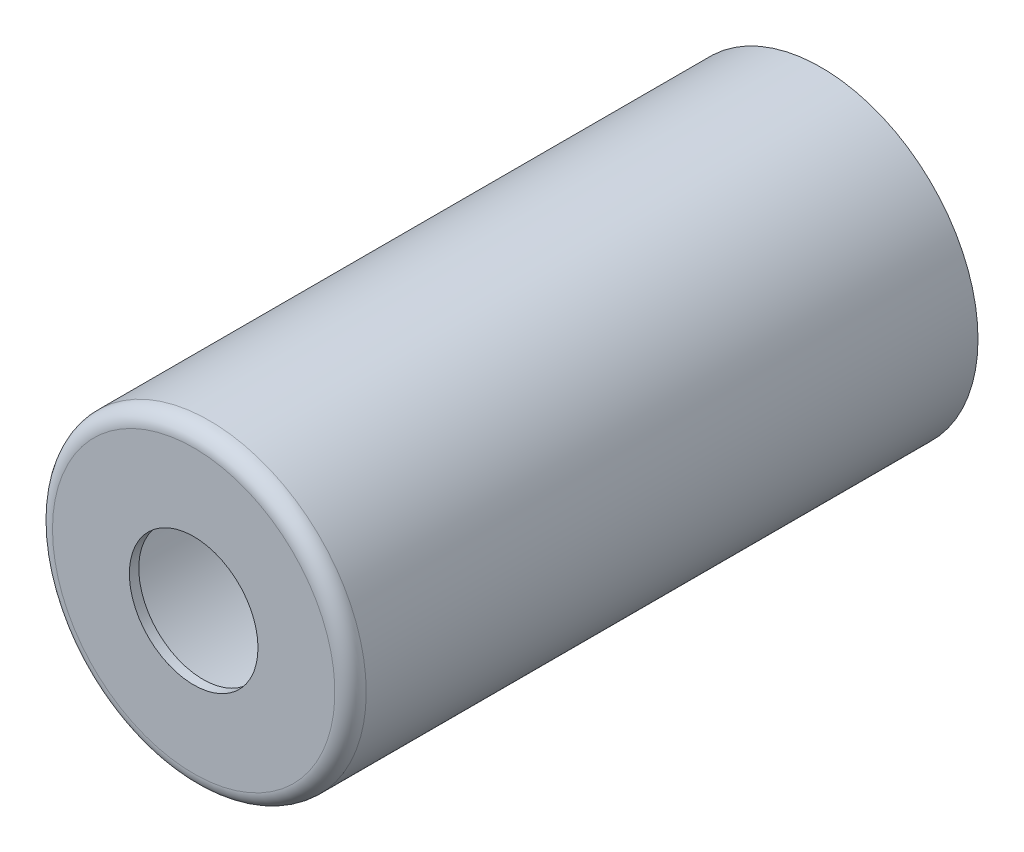
ISO-10303-21;
HEADER;
FILE_DESCRIPTION(('STEP AP214'),'2;1');
FILE_NAME('part.step','',(''),(''),'','','');
FILE_SCHEMA(('AUTOMOTIVE_DESIGN { 1 0 10303 214 1 1 1 1 }'));
ENDSEC;
DATA;
#1=APPLICATION_CONTEXT('core data for automotive mechanical design processes');
#2=APPLICATION_PROTOCOL_DEFINITION('international standard','automotive_design',2000,#1);
#3=PRODUCT_CONTEXT('',#1,'mechanical');
#4=PRODUCT('Part','Part','',(#3));
#5=PRODUCT_RELATED_PRODUCT_CATEGORY('part','',(#4));
#6=PRODUCT_DEFINITION_FORMATION('','',#4);
#7=PRODUCT_DEFINITION_CONTEXT('part definition',#1,'design');
#8=PRODUCT_DEFINITION('design','',#6,#7);
#9=PRODUCT_DEFINITION_SHAPE('','',#8);
#10=(LENGTH_UNIT() NAMED_UNIT(*) SI_UNIT(.MILLI.,.METRE.));
#11=(NAMED_UNIT(*) PLANE_ANGLE_UNIT() SI_UNIT($,.RADIAN.));
#12=(NAMED_UNIT(*) SI_UNIT($,.STERADIAN.) SOLID_ANGLE_UNIT());
#13=UNCERTAINTY_MEASURE_WITH_UNIT(LENGTH_MEASURE(1.E-05),#10,'distance_accuracy_value','');
#14=(GEOMETRIC_REPRESENTATION_CONTEXT(3) GLOBAL_UNCERTAINTY_ASSIGNED_CONTEXT((#13)) GLOBAL_UNIT_ASSIGNED_CONTEXT((#10,
#11,#12)) REPRESENTATION_CONTEXT('',''));
#15=CARTESIAN_POINT('',(0.,0.,0.));
#16=DIRECTION('',(0.,0.,1.));
#17=DIRECTION('',(1.,0.,0.));
#18=AXIS2_PLACEMENT_3D('',#15,#16,#17);
#19=CARTESIAN_POINT('',(0.,0.,0.));
#20=DIRECTION('',(0.,0.,1.));
#21=DIRECTION('',(1.,0.,0.));
#22=AXIS2_PLACEMENT_3D('',#19,#20,#21);
#23=CYLINDRICAL_SURFACE('',#22,50.);
#24=CARTESIAN_POINT('',(0.,0.,-5.));
#25=DIRECTION('',(0.,0.,-1.));
#26=DIRECTION('',(-1.,0.,0.));
#27=AXIS2_PLACEMENT_3D('',#24,#25,#26);
#28=CIRCLE('',#27,50.);
#29=CARTESIAN_POINT('',(-50.,0.,-5.));
#30=VERTEX_POINT('',#29);
#31=EDGE_CURVE('E10',#30,#30,#28,.T.);
#32=ORIENTED_EDGE('',*,*,#31,.T.);
#33=EDGE_LOOP('',(#32));
#34=FACE_BOUND('',#33,.T.);
#35=CARTESIAN_POINT('',(0.,0.,-200.));
#36=DIRECTION('',(0.,0.,1.));
#37=DIRECTION('',(1.,0.,0.));
#38=AXIS2_PLACEMENT_3D('',#35,#36,#37);
#39=CIRCLE('',#38,50.);
#40=CARTESIAN_POINT('',(50.,0.,-200.));
#41=VERTEX_POINT('',#40);
#42=EDGE_CURVE('E62',#41,#41,#39,.T.);
#43=ORIENTED_EDGE('',*,*,#42,.T.);
#44=EDGE_LOOP('',(#43));
#45=FACE_BOUND('',#44,.T.);
#46=ADVANCED_FACE('F33',(#34,#45),#23,.T.);
#47=CARTESIAN_POINT('',(0.,50.,0.));
#48=DIRECTION('',(0.,0.,-1.));
#49=DIRECTION('',(-1.,0.,0.));
#50=AXIS2_PLACEMENT_3D('',#47,#48,#49);
#51=PLANE('',#50);
#52=CARTESIAN_POINT('',(0.,0.,0.));
#53=DIRECTION('',(0.,0.,-1.));
#54=DIRECTION('',(-1.,0.,0.));
#55=AXIS2_PLACEMENT_3D('',#52,#53,#54);
#56=CIRCLE('',#55,45.);
#57=CARTESIAN_POINT('',(-45.,0.,0.));
#58=VERTEX_POINT('',#57);
#59=EDGE_CURVE('E40',#58,#58,#56,.F.);
#60=ORIENTED_EDGE('',*,*,#59,.T.);
#61=EDGE_LOOP('',(#60));
#62=FACE_BOUND('',#61,.T.);
#63=CARTESIAN_POINT('',(0.,0.,0.));
#64=DIRECTION('',(0.,0.,1.));
#65=DIRECTION('',(1.,0.,0.));
#66=AXIS2_PLACEMENT_3D('',#63,#64,#65);
#67=CIRCLE('',#66,20.5);
#68=CARTESIAN_POINT('',(20.5,0.,0.));
#69=VERTEX_POINT('',#68);
#70=EDGE_CURVE('E53',#69,#69,#67,.T.);
#71=ORIENTED_EDGE('',*,*,#70,.F.);
#72=EDGE_LOOP('',(#71));
#73=FACE_BOUND('',#72,.T.);
#74=ADVANCED_FACE('F86',(#62,#73),#51,.F.);
#75=CARTESIAN_POINT('',(0.,0.,0.));
#76=DIRECTION('',(0.,0.,1.));
#77=DIRECTION('',(1.,0.,0.));
#78=AXIS2_PLACEMENT_3D('',#75,#76,#77);
#79=CYLINDRICAL_SURFACE('',#78,20.5);
#80=CARTESIAN_POINT('',(0.,0.,-3.));
#81=DIRECTION('',(0.,0.,1.));
#82=DIRECTION('',(1.,0.,0.));
#83=AXIS2_PLACEMENT_3D('',#80,#81,#82);
#84=CIRCLE('',#83,20.5);
#85=CARTESIAN_POINT('',(20.5,0.,-3.));
#86=VERTEX_POINT('',#85);
#87=EDGE_CURVE('E56',#86,#86,#84,.T.);
#88=ORIENTED_EDGE('',*,*,#87,.F.);
#89=EDGE_LOOP('',(#88));
#90=FACE_BOUND('',#89,.T.);
#91=ORIENTED_EDGE('',*,*,#70,.T.);
#92=EDGE_LOOP('',(#91));
#93=FACE_BOUND('',#92,.T.);
#94=ADVANCED_FACE('F82',(#90,#93),#79,.F.);
#95=CARTESIAN_POINT('',(0.,20.5,-3.));
#96=DIRECTION('',(0.,0.,1.));
#97=DIRECTION('',(1.,0.,0.));
#98=AXIS2_PLACEMENT_3D('',#95,#96,#97);
#99=PLANE('',#98);
#100=CARTESIAN_POINT('',(0.,0.,-3.));
#101=DIRECTION('',(0.,0.,1.));
#102=DIRECTION('',(1.,0.,0.));
#103=AXIS2_PLACEMENT_3D('',#100,#101,#102);
#104=CIRCLE('',#103,42.);
#105=CARTESIAN_POINT('',(42.,0.,-3.));
#106=VERTEX_POINT('',#105);
#107=EDGE_CURVE('E44',#106,#106,#104,.F.);
#108=ORIENTED_EDGE('',*,*,#107,.T.);
#109=EDGE_LOOP('',(#108));
#110=FACE_BOUND('',#109,.T.);
#111=ORIENTED_EDGE('',*,*,#87,.T.);
#112=EDGE_LOOP('',(#111));
#113=FACE_BOUND('',#112,.T.);
#114=ADVANCED_FACE('F76',(#110,#113),#99,.F.);
#115=CARTESIAN_POINT('',(0.,0.,0.));
#116=DIRECTION('',(0.,0.,1.));
#117=DIRECTION('',(1.,0.,0.));
#118=AXIS2_PLACEMENT_3D('',#115,#116,#117);
#119=CYLINDRICAL_SURFACE('',#118,47.);
#120=CARTESIAN_POINT('',(0.,0.,-8.));
#121=DIRECTION('',(0.,0.,1.));
#122=DIRECTION('',(1.,0.,0.));
#123=AXIS2_PLACEMENT_3D('',#120,#121,#122);
#124=CIRCLE('',#123,47.);
#125=CARTESIAN_POINT('',(47.,0.,-8.));
#126=VERTEX_POINT('',#125);
#127=EDGE_CURVE('E48',#126,#126,#124,.T.);
#128=ORIENTED_EDGE('',*,*,#127,.T.);
#129=EDGE_LOOP('',(#128));
#130=FACE_BOUND('',#129,.T.);
#131=CARTESIAN_POINT('',(0.,0.,-200.));
#132=DIRECTION('',(0.,0.,1.));
#133=DIRECTION('',(1.,0.,0.));
#134=AXIS2_PLACEMENT_3D('',#131,#132,#133);
#135=CIRCLE('',#134,47.);
#136=CARTESIAN_POINT('',(47.,0.,-200.));
#137=VERTEX_POINT('',#136);
#138=EDGE_CURVE('E59',#137,#137,#135,.T.);
#139=ORIENTED_EDGE('',*,*,#138,.F.);
#140=EDGE_LOOP('',(#139));
#141=FACE_BOUND('',#140,.T.);
#142=ADVANCED_FACE('F71',(#130,#141),#119,.F.);
#143=CARTESIAN_POINT('',(0.,47.,-200.));
#144=DIRECTION('',(0.,0.,1.));
#145=DIRECTION('',(1.,0.,0.));
#146=AXIS2_PLACEMENT_3D('',#143,#144,#145);
#147=PLANE('',#146);
#148=ORIENTED_EDGE('',*,*,#42,.F.);
#149=EDGE_LOOP('',(#148));
#150=FACE_BOUND('',#149,.T.);
#151=ORIENTED_EDGE('',*,*,#138,.T.);
#152=EDGE_LOOP('',(#151));
#153=FACE_BOUND('',#152,.T.);
#154=ADVANCED_FACE('F67',(#150,#153),#147,.F.);
#155=CARTESIAN_POINT('',(0.,0.,-8.));
#156=DIRECTION('',(0.,0.,1.));
#157=DIRECTION('',(1.,0.,0.));
#158=AXIS2_PLACEMENT_3D('',#155,#156,#157);
#159=TOROIDAL_SURFACE('',#158,42.,5.);
#160=ORIENTED_EDGE('',*,*,#107,.F.);
#161=EDGE_LOOP('',(#160));
#162=FACE_BOUND('',#161,.T.);
#163=ORIENTED_EDGE('',*,*,#127,.F.);
#164=EDGE_LOOP('',(#163));
#165=FACE_BOUND('',#164,.T.);
#166=ADVANCED_FACE('F70',(#162,#165),#159,.F.);
#167=CARTESIAN_POINT('',(0.,0.,-5.));
#168=DIRECTION('',(0.,0.,-1.));
#169=DIRECTION('',(-1.,0.,0.));
#170=AXIS2_PLACEMENT_3D('',#167,#168,#169);
#171=TOROIDAL_SURFACE('',#170,45.,5.);
#172=ORIENTED_EDGE('',*,*,#31,.F.);
#173=EDGE_LOOP('',(#172));
#174=FACE_BOUND('',#173,.T.);
#175=ORIENTED_EDGE('',*,*,#59,.F.);
#176=EDGE_LOOP('',(#175));
#177=FACE_BOUND('',#176,.T.);
#178=ADVANCED_FACE('F35',(#174,#177),#171,.T.);
#179=CLOSED_SHELL('',(#46,#74,#94,#114,#142,#154,#166,#178));
#180=MANIFOLD_SOLID_BREP('B2',#179);
#181=ADVANCED_BREP_SHAPE_REPRESENTATION('',(#18,#180),#14);
#182=SHAPE_DEFINITION_REPRESENTATION(#9,#181);
ENDSEC;
END-ISO-10303-21;
